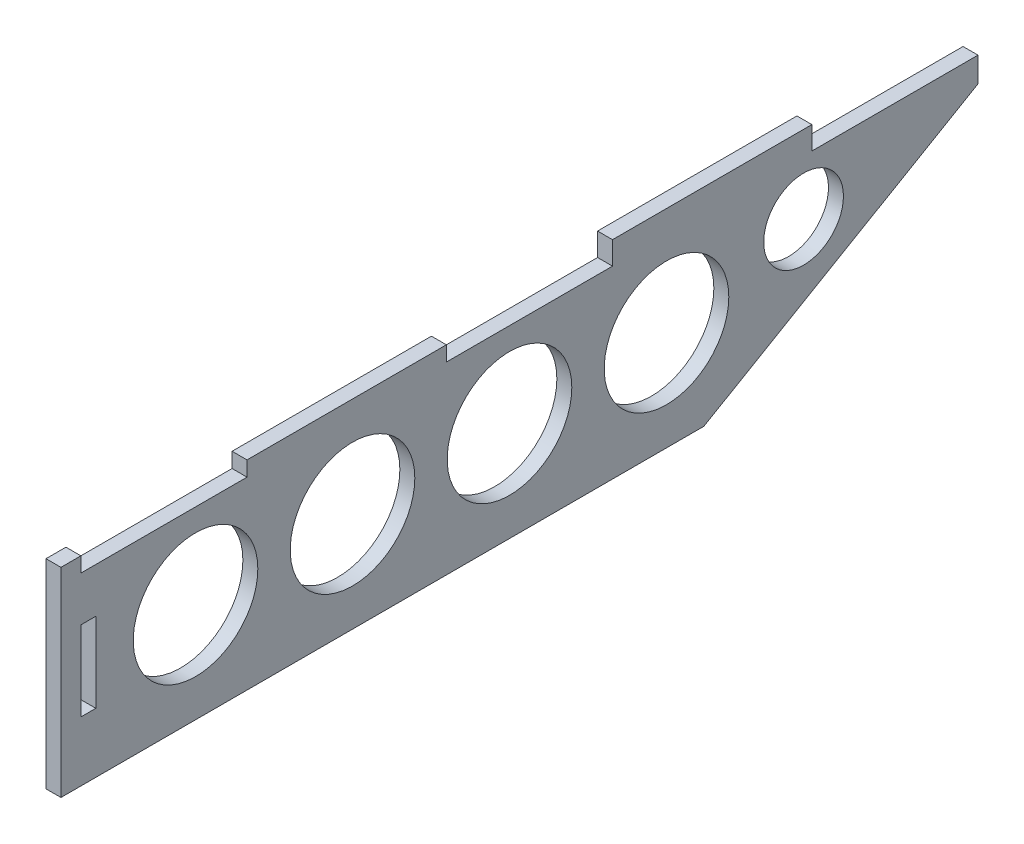
ISO-10303-21;
HEADER;
FILE_DESCRIPTION(('STEP AP214'),'2;1');
FILE_NAME('part.step','',(''),(''),'','','');
FILE_SCHEMA(('AUTOMOTIVE_DESIGN { 1 0 10303 214 1 1 1 1 }'));
ENDSEC;
DATA;
#1=APPLICATION_CONTEXT('core data for automotive mechanical design processes');
#2=APPLICATION_PROTOCOL_DEFINITION('international standard','automotive_design',2000,#1);
#3=PRODUCT_CONTEXT('',#1,'mechanical');
#4=PRODUCT('Part','Part','',(#3));
#5=PRODUCT_RELATED_PRODUCT_CATEGORY('part','',(#4));
#6=PRODUCT_DEFINITION_FORMATION('','',#4);
#7=PRODUCT_DEFINITION_CONTEXT('part definition',#1,'design');
#8=PRODUCT_DEFINITION('design','',#6,#7);
#9=PRODUCT_DEFINITION_SHAPE('','',#8);
#10=(LENGTH_UNIT() NAMED_UNIT(*) SI_UNIT(.MILLI.,.METRE.));
#11=(NAMED_UNIT(*) PLANE_ANGLE_UNIT() SI_UNIT($,.RADIAN.));
#12=(NAMED_UNIT(*) SI_UNIT($,.STERADIAN.) SOLID_ANGLE_UNIT());
#13=UNCERTAINTY_MEASURE_WITH_UNIT(LENGTH_MEASURE(1.E-05),#10,'distance_accuracy_value','');
#14=(GEOMETRIC_REPRESENTATION_CONTEXT(3) GLOBAL_UNCERTAINTY_ASSIGNED_CONTEXT((#13)) GLOBAL_UNIT_ASSIGNED_CONTEXT((#10,
#11,#12)) REPRESENTATION_CONTEXT('',''));
#15=CARTESIAN_POINT('',(0.,0.,0.));
#16=DIRECTION('',(0.,0.,1.));
#17=DIRECTION('',(1.,0.,0.));
#18=AXIS2_PLACEMENT_3D('',#15,#16,#17);
#19=CARTESIAN_POINT('',(3.,-12.,0.));
#20=DIRECTION('',(0.,1.,0.));
#21=DIRECTION('',(0.,0.,1.));
#22=AXIS2_PLACEMENT_3D('',#19,#20,#21);
#23=PLANE('',#22);
#24=DIRECTION('',(0.,0.,-1.));
#25=VECTOR('',#24,1.);
#26=CARTESIAN_POINT('',(0.,-12.,0.));
#27=LINE('',#26,#25);
#28=CARTESIAN_POINT('',(0.,-12.,0.));
#29=VERTEX_POINT('',#28);
#30=CARTESIAN_POINT('',(0.,-12.,-3.));
#31=VERTEX_POINT('',#30);
#32=EDGE_CURVE('E277',#29,#31,#27,.T.);
#33=ORIENTED_EDGE('',*,*,#32,.T.);
#34=DIRECTION('',(-1.,0.,0.));
#35=VECTOR('',#34,1.);
#36=CARTESIAN_POINT('',(3.,-12.,-3.));
#37=LINE('',#36,#35);
#38=CARTESIAN_POINT('',(3.,-12.,-3.));
#39=VERTEX_POINT('',#38);
#40=EDGE_CURVE('E11',#39,#31,#37,.T.);
#41=ORIENTED_EDGE('',*,*,#40,.F.);
#42=DIRECTION('',(0.,0.,-1.));
#43=VECTOR('',#42,1.);
#44=CARTESIAN_POINT('',(3.,-12.,0.));
#45=LINE('',#44,#43);
#46=CARTESIAN_POINT('',(3.,-12.,0.));
#47=VERTEX_POINT('',#46);
#48=EDGE_CURVE('E179',#47,#39,#45,.T.);
#49=ORIENTED_EDGE('',*,*,#48,.F.);
#50=DIRECTION('',(-1.,0.,0.));
#51=VECTOR('',#50,1.);
#52=CARTESIAN_POINT('',(3.,-12.,0.));
#53=LINE('',#52,#51);
#54=EDGE_CURVE('E61',#47,#29,#53,.T.);
#55=ORIENTED_EDGE('',*,*,#54,.T.);
#56=EDGE_LOOP('',(#33,#41,#49,#55));
#57=FACE_BOUND('',#56,.T.);
#58=ADVANCED_FACE('F41',(#57),#23,.F.);
#59=CARTESIAN_POINT('',(3.,0.,-3.));
#60=DIRECTION('',(0.,0.,-1.));
#61=DIRECTION('',(0.,1.,0.));
#62=AXIS2_PLACEMENT_3D('',#59,#60,#61);
#63=PLANE('',#62);
#64=DIRECTION('',(0.,-1.,0.));
#65=VECTOR('',#64,1.);
#66=CARTESIAN_POINT('',(0.,0.,-3.));
#67=LINE('',#66,#65);
#68=CARTESIAN_POINT('',(0.,-28.,-3.));
#69=VERTEX_POINT('',#68);
#70=EDGE_CURVE('E186',#31,#69,#67,.T.);
#71=ORIENTED_EDGE('',*,*,#70,.T.);
#72=DIRECTION('',(-1.,0.,0.));
#73=VECTOR('',#72,1.);
#74=CARTESIAN_POINT('',(3.,-28.,-3.));
#75=LINE('',#74,#73);
#76=CARTESIAN_POINT('',(3.,-28.,-3.));
#77=VERTEX_POINT('',#76);
#78=EDGE_CURVE('E52',#77,#69,#75,.T.);
#79=ORIENTED_EDGE('',*,*,#78,.F.);
#80=DIRECTION('',(0.,-1.,0.));
#81=VECTOR('',#80,1.);
#82=CARTESIAN_POINT('',(3.,0.,-3.));
#83=LINE('',#82,#81);
#84=EDGE_CURVE('E173',#39,#77,#83,.T.);
#85=ORIENTED_EDGE('',*,*,#84,.F.);
#86=ORIENTED_EDGE('',*,*,#40,.T.);
#87=EDGE_LOOP('',(#71,#79,#85,#86));
#88=FACE_BOUND('',#87,.T.);
#89=ADVANCED_FACE('F185',(#88),#63,.F.);
#90=CARTESIAN_POINT('',(3.,-28.,0.));
#91=DIRECTION('',(0.,1.,0.));
#92=DIRECTION('',(0.,0.,1.));
#93=AXIS2_PLACEMENT_3D('',#90,#91,#92);
#94=PLANE('',#93);
#95=DIRECTION('',(0.,0.,-1.));
#96=VECTOR('',#95,1.);
#97=CARTESIAN_POINT('',(0.,-28.,0.));
#98=LINE('',#97,#96);
#99=CARTESIAN_POINT('',(0.,-28.,0.));
#100=VERTEX_POINT('',#99);
#101=EDGE_CURVE('E282',#100,#69,#98,.T.);
#102=ORIENTED_EDGE('',*,*,#101,.F.);
#103=DIRECTION('',(-1.,0.,0.));
#104=VECTOR('',#103,1.);
#105=CARTESIAN_POINT('',(3.,-28.,0.));
#106=LINE('',#105,#104);
#107=CARTESIAN_POINT('',(3.,-28.,0.));
#108=VERTEX_POINT('',#107);
#109=EDGE_CURVE('E115',#108,#100,#106,.T.);
#110=ORIENTED_EDGE('',*,*,#109,.F.);
#111=DIRECTION('',(0.,0.,-1.));
#112=VECTOR('',#111,1.);
#113=CARTESIAN_POINT('',(3.,-28.,0.));
#114=LINE('',#113,#112);
#115=EDGE_CURVE('E178',#108,#77,#114,.T.);
#116=ORIENTED_EDGE('',*,*,#115,.T.);
#117=ORIENTED_EDGE('',*,*,#78,.T.);
#118=EDGE_LOOP('',(#102,#110,#116,#117));
#119=FACE_BOUND('',#118,.T.);
#120=ADVANCED_FACE('F191',(#119),#94,.T.);
#121=CARTESIAN_POINT('',(3.,0.,0.));
#122=DIRECTION('',(0.,1.,0.));
#123=DIRECTION('',(0.,0.,1.));
#124=AXIS2_PLACEMENT_3D('',#121,#122,#123);
#125=PLANE('',#124);
#126=DIRECTION('',(0.,0.,-1.));
#127=VECTOR('',#126,1.);
#128=CARTESIAN_POINT('',(0.,0.,0.));
#129=LINE('',#128,#127);
#130=CARTESIAN_POINT('',(0.,0.,4.));
#131=VERTEX_POINT('',#130);
#132=CARTESIAN_POINT('',(0.,0.,0.));
#133=VERTEX_POINT('',#132);
#134=EDGE_CURVE('E221',#131,#133,#129,.T.);
#135=ORIENTED_EDGE('',*,*,#134,.F.);
#136=DIRECTION('',(-1.,0.,0.));
#137=VECTOR('',#136,1.);
#138=CARTESIAN_POINT('',(3.,0.,4.));
#139=LINE('',#138,#137);
#140=CARTESIAN_POINT('',(3.,0.,4.));
#141=VERTEX_POINT('',#140);
#142=EDGE_CURVE('E45',#141,#131,#139,.T.);
#143=ORIENTED_EDGE('',*,*,#142,.F.);
#144=DIRECTION('',(0.,0.,-1.));
#145=VECTOR('',#144,1.);
#146=CARTESIAN_POINT('',(3.,0.,0.));
#147=LINE('',#146,#145);
#148=CARTESIAN_POINT('',(3.,0.,0.));
#149=VERTEX_POINT('',#148);
#150=EDGE_CURVE('E402',#141,#149,#147,.T.);
#151=ORIENTED_EDGE('',*,*,#150,.T.);
#152=DIRECTION('',(-1.,0.,0.));
#153=VECTOR('',#152,1.);
#154=CARTESIAN_POINT('',(3.,0.,0.));
#155=LINE('',#154,#153);
#156=EDGE_CURVE('E196',#149,#133,#155,.T.);
#157=ORIENTED_EDGE('',*,*,#156,.T.);
#158=EDGE_LOOP('',(#135,#143,#151,#157));
#159=FACE_BOUND('',#158,.T.);
#160=ADVANCED_FACE('F337',(#159),#125,.T.);
#161=CARTESIAN_POINT('',(3.,0.,4.));
#162=DIRECTION('',(0.,0.,1.));
#163=DIRECTION('',(1.,0.,0.));
#164=AXIS2_PLACEMENT_3D('',#161,#162,#163);
#165=PLANE('',#164);
#166=DIRECTION('',(0.,1.,0.));
#167=VECTOR('',#166,1.);
#168=CARTESIAN_POINT('',(0.,0.,4.));
#169=LINE('',#168,#167);
#170=CARTESIAN_POINT('',(0.,-40.,4.));
#171=VERTEX_POINT('',#170);
#172=EDGE_CURVE('E225',#171,#131,#169,.T.);
#173=ORIENTED_EDGE('',*,*,#172,.F.);
#174=DIRECTION('',(-1.,0.,0.));
#175=VECTOR('',#174,1.);
#176=CARTESIAN_POINT('',(3.,-40.,4.));
#177=LINE('',#176,#175);
#178=CARTESIAN_POINT('',(3.,-40.,4.));
#179=VERTEX_POINT('',#178);
#180=EDGE_CURVE('E325',#179,#171,#177,.T.);
#181=ORIENTED_EDGE('',*,*,#180,.F.);
#182=DIRECTION('',(0.,1.,0.));
#183=VECTOR('',#182,1.);
#184=CARTESIAN_POINT('',(3.,0.,4.));
#185=LINE('',#184,#183);
#186=EDGE_CURVE('E336',#179,#141,#185,.T.);
#187=ORIENTED_EDGE('',*,*,#186,.T.);
#188=ORIENTED_EDGE('',*,*,#142,.T.);
#189=EDGE_LOOP('',(#173,#181,#187,#188));
#190=FACE_BOUND('',#189,.T.);
#191=ADVANCED_FACE('F334',(#190),#165,.T.);
#192=CARTESIAN_POINT('',(3.,-40.,0.));
#193=DIRECTION('',(0.,-1.,0.));
#194=DIRECTION('',(0.,0.,-1.));
#195=AXIS2_PLACEMENT_3D('',#192,#193,#194);
#196=PLANE('',#195);
#197=DIRECTION('',(0.,0.,1.));
#198=VECTOR('',#197,1.);
#199=CARTESIAN_POINT('',(0.,-40.,0.));
#200=LINE('',#199,#198);
#201=CARTESIAN_POINT('',(0.,-40.,-125.));
#202=VERTEX_POINT('',#201);
#203=EDGE_CURVE('E229',#202,#171,#200,.T.);
#204=ORIENTED_EDGE('',*,*,#203,.F.);
#205=DIRECTION('',(-1.,0.,0.));
#206=VECTOR('',#205,1.);
#207=CARTESIAN_POINT('',(3.,-40.,-125.));
#208=LINE('',#207,#206);
#209=CARTESIAN_POINT('',(3.,-40.,-125.));
#210=VERTEX_POINT('',#209);
#211=EDGE_CURVE('E323',#210,#202,#208,.T.);
#212=ORIENTED_EDGE('',*,*,#211,.F.);
#213=DIRECTION('',(0.,0.,1.));
#214=VECTOR('',#213,1.);
#215=CARTESIAN_POINT('',(3.,-40.,0.));
#216=LINE('',#215,#214);
#217=EDGE_CURVE('E345',#210,#179,#216,.T.);
#218=ORIENTED_EDGE('',*,*,#217,.T.);
#219=ORIENTED_EDGE('',*,*,#180,.T.);
#220=EDGE_LOOP('',(#204,#212,#218,#219));
#221=FACE_BOUND('',#220,.T.);
#222=ADVANCED_FACE('F343',(#221),#196,.T.);
#223=CARTESIAN_POINT('',(3.,-84.2183255124722,-48.9997530254384));
#224=DIRECTION('',(0.,-0.864348337709377,-0.502893578303638));
#225=DIRECTION('',(0.,0.502893578303638,-0.864348337709377));
#226=AXIS2_PLACEMENT_3D('',#223,#224,#225);
#227=PLANE('',#226);
#228=DIRECTION('',(0.,-0.502893578303638,0.864348337709377));
#229=VECTOR('',#228,1.);
#230=CARTESIAN_POINT('',(0.,-84.2183255124722,-48.9997530254384));
#231=LINE('',#230,#229);
#232=CARTESIAN_POINT('',(0.,-8.00000000000001,-180.));
#233=VERTEX_POINT('',#232);
#234=EDGE_CURVE('E233',#233,#202,#231,.T.);
#235=ORIENTED_EDGE('',*,*,#234,.F.);
#236=DIRECTION('',(-1.,0.,0.));
#237=VECTOR('',#236,1.);
#238=CARTESIAN_POINT('',(3.,-8.00000000000001,-180.));
#239=LINE('',#238,#237);
#240=CARTESIAN_POINT('',(3.,-8.00000000000001,-180.));
#241=VERTEX_POINT('',#240);
#242=EDGE_CURVE('E320',#241,#233,#239,.T.);
#243=ORIENTED_EDGE('',*,*,#242,.F.);
#244=DIRECTION('',(0.,-0.502893578303638,0.864348337709377));
#245=VECTOR('',#244,1.);
#246=CARTESIAN_POINT('',(3.,-84.2183255124722,-48.9997530254384));
#247=LINE('',#246,#245);
#248=EDGE_CURVE('E351',#241,#210,#247,.T.);
#249=ORIENTED_EDGE('',*,*,#248,.T.);
#250=ORIENTED_EDGE('',*,*,#211,.T.);
#251=EDGE_LOOP('',(#235,#243,#249,#250));
#252=FACE_BOUND('',#251,.T.);
#253=ADVANCED_FACE('F355',(#252),#227,.T.);
#254=CARTESIAN_POINT('',(3.,0.,-180.));
#255=DIRECTION('',(0.,0.,-1.));
#256=DIRECTION('',(-1.,0.,0.));
#257=AXIS2_PLACEMENT_3D('',#254,#255,#256);
#258=PLANE('',#257);
#259=DIRECTION('',(0.,-1.,0.));
#260=VECTOR('',#259,1.);
#261=CARTESIAN_POINT('',(0.,0.,-180.));
#262=LINE('',#261,#260);
#263=CARTESIAN_POINT('',(0.,-3.,-180.));
#264=VERTEX_POINT('',#263);
#265=EDGE_CURVE('E237',#264,#233,#262,.T.);
#266=ORIENTED_EDGE('',*,*,#265,.F.);
#267=DIRECTION('',(-1.,0.,0.));
#268=VECTOR('',#267,1.);
#269=CARTESIAN_POINT('',(3.,-3.,-180.));
#270=LINE('',#269,#268);
#271=CARTESIAN_POINT('',(3.,-3.,-180.));
#272=VERTEX_POINT('',#271);
#273=EDGE_CURVE('E317',#272,#264,#270,.T.);
#274=ORIENTED_EDGE('',*,*,#273,.F.);
#275=DIRECTION('',(0.,-1.,0.));
#276=VECTOR('',#275,1.);
#277=CARTESIAN_POINT('',(3.,0.,-180.));
#278=LINE('',#277,#276);
#279=EDGE_CURVE('E357',#272,#241,#278,.T.);
#280=ORIENTED_EDGE('',*,*,#279,.T.);
#281=ORIENTED_EDGE('',*,*,#242,.T.);
#282=EDGE_LOOP('',(#266,#274,#280,#281));
#283=FACE_BOUND('',#282,.T.);
#284=ADVANCED_FACE('F520',(#283),#258,.T.);
#285=CARTESIAN_POINT('',(3.,-3.,0.));
#286=DIRECTION('',(0.,1.,0.));
#287=DIRECTION('',(0.,0.,1.));
#288=AXIS2_PLACEMENT_3D('',#285,#286,#287);
#289=PLANE('',#288);
#290=DIRECTION('',(0.,0.,-1.));
#291=VECTOR('',#290,1.);
#292=CARTESIAN_POINT('',(0.,-3.,0.));
#293=LINE('',#292,#291);
#294=CARTESIAN_POINT('',(0.,-3.,-146.666666666667));
#295=VERTEX_POINT('',#294);
#296=EDGE_CURVE('E241',#295,#264,#293,.T.);
#297=ORIENTED_EDGE('',*,*,#296,.F.);
#298=DIRECTION('',(-1.,0.,0.));
#299=VECTOR('',#298,1.);
#300=CARTESIAN_POINT('',(3.,-3.,-146.666666666667));
#301=LINE('',#300,#299);
#302=CARTESIAN_POINT('',(3.,-3.,-146.666666666667));
#303=VERTEX_POINT('',#302);
#304=EDGE_CURVE('E314',#303,#295,#301,.T.);
#305=ORIENTED_EDGE('',*,*,#304,.F.);
#306=DIRECTION('',(0.,0.,-1.));
#307=VECTOR('',#306,1.);
#308=CARTESIAN_POINT('',(3.,-3.,0.));
#309=LINE('',#308,#307);
#310=EDGE_CURVE('E360',#303,#272,#309,.T.);
#311=ORIENTED_EDGE('',*,*,#310,.T.);
#312=ORIENTED_EDGE('',*,*,#273,.T.);
#313=EDGE_LOOP('',(#297,#305,#311,#312));
#314=FACE_BOUND('',#313,.T.);
#315=ADVANCED_FACE('F516',(#314),#289,.T.);
#316=CARTESIAN_POINT('',(3.,0.,-146.666666666667));
#317=DIRECTION('',(0.,0.,-1.));
#318=DIRECTION('',(-1.,0.,0.));
#319=AXIS2_PLACEMENT_3D('',#316,#317,#318);
#320=PLANE('',#319);
#321=DIRECTION('',(0.,-1.,0.));
#322=VECTOR('',#321,1.);
#323=CARTESIAN_POINT('',(0.,0.,-146.666666666667));
#324=LINE('',#323,#322);
#325=CARTESIAN_POINT('',(0.,1.6,-146.666666666667));
#326=VERTEX_POINT('',#325);
#327=EDGE_CURVE('E245',#326,#295,#324,.T.);
#328=ORIENTED_EDGE('',*,*,#327,.F.);
#329=DIRECTION('',(1.,0.,0.));
#330=VECTOR('',#329,1.);
#331=CARTESIAN_POINT('',(0.,1.6,-146.666666666667));
#332=LINE('',#331,#330);
#333=CARTESIAN_POINT('',(3.,1.6,-146.666666666667));
#334=VERTEX_POINT('',#333);
#335=EDGE_CURVE('E436',#326,#334,#332,.T.);
#336=ORIENTED_EDGE('',*,*,#335,.T.);
#337=DIRECTION('',(0.,-1.,0.));
#338=VECTOR('',#337,1.);
#339=CARTESIAN_POINT('',(3.,0.,-146.666666666667));
#340=LINE('',#339,#338);
#341=EDGE_CURVE('E367',#334,#303,#340,.T.);
#342=ORIENTED_EDGE('',*,*,#341,.T.);
#343=ORIENTED_EDGE('',*,*,#304,.T.);
#344=EDGE_LOOP('',(#328,#336,#342,#343));
#345=FACE_BOUND('',#344,.T.);
#346=ADVANCED_FACE('F513',(#345),#320,.T.);
#347=CARTESIAN_POINT('',(3.,-4.93432455388958E-13,-106.666666666667));
#348=DIRECTION('',(0.,0.,-1.));
#349=DIRECTION('',(0.,1.,0.));
#350=AXIS2_PLACEMENT_3D('',#347,#348,#349);
#351=PLANE('',#350);
#352=DIRECTION('',(0.,-1.,0.));
#353=VECTOR('',#352,1.);
#354=CARTESIAN_POINT('',(0.,-4.93432455388958E-13,-106.666666666667));
#355=LINE('',#354,#353);
#356=CARTESIAN_POINT('',(0.,1.6,-106.666666666667));
#357=VERTEX_POINT('',#356);
#358=CARTESIAN_POINT('',(0.,-3.,-106.666666666667));
#359=VERTEX_POINT('',#358);
#360=EDGE_CURVE('E249',#357,#359,#355,.T.);
#361=ORIENTED_EDGE('',*,*,#360,.T.);
#362=DIRECTION('',(-1.,0.,0.));
#363=VECTOR('',#362,1.);
#364=CARTESIAN_POINT('',(3.,-3.,-106.666666666667));
#365=LINE('',#364,#363);
#366=CARTESIAN_POINT('',(3.,-3.,-106.666666666667));
#367=VERTEX_POINT('',#366);
#368=EDGE_CURVE('E311',#367,#359,#365,.T.);
#369=ORIENTED_EDGE('',*,*,#368,.F.);
#370=DIRECTION('',(0.,-1.,0.));
#371=VECTOR('',#370,1.);
#372=CARTESIAN_POINT('',(3.,-4.93432455388958E-13,-106.666666666667));
#373=LINE('',#372,#371);
#374=CARTESIAN_POINT('',(3.,1.6,-106.666666666667));
#375=VERTEX_POINT('',#374);
#376=EDGE_CURVE('E371',#375,#367,#373,.T.);
#377=ORIENTED_EDGE('',*,*,#376,.F.);
#378=DIRECTION('',(1.,0.,0.));
#379=VECTOR('',#378,1.);
#380=CARTESIAN_POINT('',(0.,1.6,-106.666666666667));
#381=LINE('',#380,#379);
#382=EDGE_CURVE('E205',#357,#375,#381,.T.);
#383=ORIENTED_EDGE('',*,*,#382,.F.);
#384=EDGE_LOOP('',(#361,#369,#377,#383));
#385=FACE_BOUND('',#384,.T.);
#386=ADVANCED_FACE('F427',(#385),#351,.F.);
#387=CARTESIAN_POINT('',(3.,-3.,0.));
#388=DIRECTION('',(0.,1.,0.));
#389=DIRECTION('',(0.,0.,1.));
#390=AXIS2_PLACEMENT_3D('',#387,#388,#389);
#391=PLANE('',#390);
#392=DIRECTION('',(0.,0.,-1.));
#393=VECTOR('',#392,1.);
#394=CARTESIAN_POINT('',(0.,-3.,0.));
#395=LINE('',#394,#393);
#396=CARTESIAN_POINT('',(0.,-3.,-73.3333333333333));
#397=VERTEX_POINT('',#396);
#398=EDGE_CURVE('E259',#397,#359,#395,.T.);
#399=ORIENTED_EDGE('',*,*,#398,.F.);
#400=DIRECTION('',(-1.,0.,0.));
#401=VECTOR('',#400,1.);
#402=CARTESIAN_POINT('',(3.,-3.,-73.3333333333333));
#403=LINE('',#402,#401);
#404=CARTESIAN_POINT('',(3.,-3.,-73.3333333333333));
#405=VERTEX_POINT('',#404);
#406=EDGE_CURVE('E308',#405,#397,#403,.T.);
#407=ORIENTED_EDGE('',*,*,#406,.F.);
#408=DIRECTION('',(0.,0.,-1.));
#409=VECTOR('',#408,1.);
#410=CARTESIAN_POINT('',(3.,-3.,0.));
#411=LINE('',#410,#409);
#412=EDGE_CURVE('E380',#405,#367,#411,.T.);
#413=ORIENTED_EDGE('',*,*,#412,.T.);
#414=ORIENTED_EDGE('',*,*,#368,.T.);
#415=EDGE_LOOP('',(#399,#407,#413,#414));
#416=FACE_BOUND('',#415,.T.);
#417=ADVANCED_FACE('F422',(#416),#391,.T.);
#418=CARTESIAN_POINT('',(3.,0.,-73.3333333333333));
#419=DIRECTION('',(0.,0.,-1.));
#420=DIRECTION('',(-1.,0.,0.));
#421=AXIS2_PLACEMENT_3D('',#418,#419,#420);
#422=PLANE('',#421);
#423=DIRECTION('',(0.,-1.,0.));
#424=VECTOR('',#423,1.);
#425=CARTESIAN_POINT('',(0.,0.,-73.3333333333333));
#426=LINE('',#425,#424);
#427=CARTESIAN_POINT('',(0.,0.,-73.3333333333333));
#428=VERTEX_POINT('',#427);
#429=EDGE_CURVE('E255',#428,#397,#426,.T.);
#430=ORIENTED_EDGE('',*,*,#429,.F.);
#431=DIRECTION('',(-1.,0.,0.));
#432=VECTOR('',#431,1.);
#433=CARTESIAN_POINT('',(3.,0.,-73.3333333333333));
#434=LINE('',#433,#432);
#435=CARTESIAN_POINT('',(3.,0.,-73.3333333333333));
#436=VERTEX_POINT('',#435);
#437=EDGE_CURVE('E305',#436,#428,#434,.T.);
#438=ORIENTED_EDGE('',*,*,#437,.F.);
#439=DIRECTION('',(0.,-1.,0.));
#440=VECTOR('',#439,1.);
#441=CARTESIAN_POINT('',(3.,0.,-73.3333333333333));
#442=LINE('',#441,#440);
#443=EDGE_CURVE('E377',#436,#405,#442,.T.);
#444=ORIENTED_EDGE('',*,*,#443,.T.);
#445=ORIENTED_EDGE('',*,*,#406,.T.);
#446=EDGE_LOOP('',(#430,#438,#444,#445));
#447=FACE_BOUND('',#446,.T.);
#448=ADVANCED_FACE('F416',(#447),#422,.T.);
#449=CARTESIAN_POINT('',(3.,0.,0.));
#450=DIRECTION('',(0.,1.,0.));
#451=DIRECTION('',(0.,0.,1.));
#452=AXIS2_PLACEMENT_3D('',#449,#450,#451);
#453=PLANE('',#452);
#454=DIRECTION('',(0.,0.,-1.));
#455=VECTOR('',#454,1.);
#456=CARTESIAN_POINT('',(0.,0.,0.));
#457=LINE('',#456,#455);
#458=CARTESIAN_POINT('',(0.,0.,-33.3333333333333));
#459=VERTEX_POINT('',#458);
#460=EDGE_CURVE('E250',#459,#428,#457,.T.);
#461=ORIENTED_EDGE('',*,*,#460,.F.);
#462=DIRECTION('',(-1.,0.,0.));
#463=VECTOR('',#462,1.);
#464=CARTESIAN_POINT('',(3.,0.,-33.3333333333333));
#465=LINE('',#464,#463);
#466=CARTESIAN_POINT('',(3.,0.,-33.3333333333333));
#467=VERTEX_POINT('',#466);
#468=EDGE_CURVE('E302',#467,#459,#465,.T.);
#469=ORIENTED_EDGE('',*,*,#468,.F.);
#470=DIRECTION('',(0.,0.,-1.));
#471=VECTOR('',#470,1.);
#472=CARTESIAN_POINT('',(3.,0.,0.));
#473=LINE('',#472,#471);
#474=EDGE_CURVE('E372',#467,#436,#473,.T.);
#475=ORIENTED_EDGE('',*,*,#474,.T.);
#476=ORIENTED_EDGE('',*,*,#437,.T.);
#477=EDGE_LOOP('',(#461,#469,#475,#476));
#478=FACE_BOUND('',#477,.T.);
#479=ADVANCED_FACE('F412',(#478),#453,.T.);
#480=CARTESIAN_POINT('',(3.,0.,-33.3333333333333));
#481=DIRECTION('',(0.,0.,-1.));
#482=DIRECTION('',(0.,1.,0.));
#483=AXIS2_PLACEMENT_3D('',#480,#481,#482);
#484=PLANE('',#483);
#485=DIRECTION('',(0.,-1.,0.));
#486=VECTOR('',#485,1.);
#487=CARTESIAN_POINT('',(0.,0.,-33.3333333333333));
#488=LINE('',#487,#486);
#489=CARTESIAN_POINT('',(0.,-3.,-33.3333333333333));
#490=VERTEX_POINT('',#489);
#491=EDGE_CURVE('E254',#459,#490,#488,.T.);
#492=ORIENTED_EDGE('',*,*,#491,.T.);
#493=DIRECTION('',(-1.,0.,0.));
#494=VECTOR('',#493,1.);
#495=CARTESIAN_POINT('',(3.,-3.,-33.3333333333333));
#496=LINE('',#495,#494);
#497=CARTESIAN_POINT('',(3.,-3.,-33.3333333333333));
#498=VERTEX_POINT('',#497);
#499=EDGE_CURVE('E299',#498,#490,#496,.T.);
#500=ORIENTED_EDGE('',*,*,#499,.F.);
#501=DIRECTION('',(0.,-1.,0.));
#502=VECTOR('',#501,1.);
#503=CARTESIAN_POINT('',(3.,0.,-33.3333333333333));
#504=LINE('',#503,#502);
#505=EDGE_CURVE('E376',#467,#498,#504,.T.);
#506=ORIENTED_EDGE('',*,*,#505,.F.);
#507=ORIENTED_EDGE('',*,*,#468,.T.);
#508=EDGE_LOOP('',(#492,#500,#506,#507));
#509=FACE_BOUND('',#508,.T.);
#510=ADVANCED_FACE('F503',(#509),#484,.F.);
#511=CARTESIAN_POINT('',(3.,-3.,0.));
#512=DIRECTION('',(0.,1.,0.));
#513=DIRECTION('',(0.,0.,1.));
#514=AXIS2_PLACEMENT_3D('',#511,#512,#513);
#515=PLANE('',#514);
#516=DIRECTION('',(0.,0.,-1.));
#517=VECTOR('',#516,1.);
#518=CARTESIAN_POINT('',(0.,-3.,0.));
#519=LINE('',#518,#517);
#520=CARTESIAN_POINT('',(0.,-3.,0.));
#521=VERTEX_POINT('',#520);
#522=EDGE_CURVE('E269',#521,#490,#519,.T.);
#523=ORIENTED_EDGE('',*,*,#522,.F.);
#524=DIRECTION('',(-1.,0.,0.));
#525=VECTOR('',#524,1.);
#526=CARTESIAN_POINT('',(3.,-3.,0.));
#527=LINE('',#526,#525);
#528=CARTESIAN_POINT('',(3.,-3.,0.));
#529=VERTEX_POINT('',#528);
#530=EDGE_CURVE('E296',#529,#521,#527,.T.);
#531=ORIENTED_EDGE('',*,*,#530,.F.);
#532=DIRECTION('',(0.,0.,-1.));
#533=VECTOR('',#532,1.);
#534=CARTESIAN_POINT('',(3.,-3.,0.));
#535=LINE('',#534,#533);
#536=EDGE_CURVE('E389',#529,#498,#535,.T.);
#537=ORIENTED_EDGE('',*,*,#536,.T.);
#538=ORIENTED_EDGE('',*,*,#499,.T.);
#539=EDGE_LOOP('',(#523,#531,#537,#538));
#540=FACE_BOUND('',#539,.T.);
#541=ADVANCED_FACE('F407',(#540),#515,.T.);
#542=CARTESIAN_POINT('',(3.,0.,0.));
#543=DIRECTION('',(0.,0.,-1.));
#544=DIRECTION('',(0.,1.,0.));
#545=AXIS2_PLACEMENT_3D('',#542,#543,#544);
#546=PLANE('',#545);
#547=DIRECTION('',(0.,-1.,0.));
#548=VECTOR('',#547,1.);
#549=CARTESIAN_POINT('',(0.,0.,0.));
#550=LINE('',#549,#548);
#551=EDGE_CURVE('E273',#133,#521,#550,.T.);
#552=ORIENTED_EDGE('',*,*,#551,.F.);
#553=ORIENTED_EDGE('',*,*,#156,.F.);
#554=DIRECTION('',(0.,-1.,0.));
#555=VECTOR('',#554,1.);
#556=CARTESIAN_POINT('',(3.,0.,0.));
#557=LINE('',#556,#555);
#558=EDGE_CURVE('E393',#149,#529,#557,.T.);
#559=ORIENTED_EDGE('',*,*,#558,.T.);
#560=ORIENTED_EDGE('',*,*,#530,.T.);
#561=EDGE_LOOP('',(#552,#553,#559,#560));
#562=FACE_BOUND('',#561,.T.);
#563=ADVANCED_FACE('F399',(#562),#546,.T.);
#564=CARTESIAN_POINT('',(3.,-20.,-23.));
#565=DIRECTION('',(-1.,0.,0.));
#566=DIRECTION('',(0.,0.,1.));
#567=AXIS2_PLACEMENT_3D('',#564,#565,#566);
#568=CYLINDRICAL_SURFACE('',#567,12.5);
#569=CARTESIAN_POINT('',(3.,-20.,-23.));
#570=DIRECTION('',(1.,0.,0.));
#571=DIRECTION('',(0.,0.,-1.));
#572=AXIS2_PLACEMENT_3D('',#569,#570,#571);
#573=CIRCLE('',#572,12.5);
#574=CARTESIAN_POINT('',(3.,-20.,-35.5));
#575=VERTEX_POINT('',#574);
#576=EDGE_CURVE('E465',#575,#575,#573,.T.);
#577=ORIENTED_EDGE('',*,*,#576,.T.);
#578=EDGE_LOOP('',(#577));
#579=FACE_BOUND('',#578,.T.);
#580=CARTESIAN_POINT('',(0.,-20.,-23.));
#581=DIRECTION('',(1.,0.,0.));
#582=DIRECTION('',(0.,0.,-1.));
#583=AXIS2_PLACEMENT_3D('',#580,#581,#582);
#584=CIRCLE('',#583,12.5);
#585=CARTESIAN_POINT('',(0.,-20.,-35.5));
#586=VERTEX_POINT('',#585);
#587=EDGE_CURVE('E217',#586,#586,#584,.T.);
#588=ORIENTED_EDGE('',*,*,#587,.F.);
#589=EDGE_LOOP('',(#588));
#590=FACE_BOUND('',#589,.T.);
#591=ADVANCED_FACE('F473',(#579,#590),#568,.F.);
#592=CARTESIAN_POINT('',(3.,-20.,-54.5));
#593=DIRECTION('',(-1.,0.,0.));
#594=DIRECTION('',(0.,0.,1.));
#595=AXIS2_PLACEMENT_3D('',#592,#593,#594);
#596=CYLINDRICAL_SURFACE('',#595,12.5);
#597=CARTESIAN_POINT('',(3.,-20.,-54.5));
#598=DIRECTION('',(1.,0.,0.));
#599=DIRECTION('',(0.,0.,-1.));
#600=AXIS2_PLACEMENT_3D('',#597,#598,#599);
#601=CIRCLE('',#600,12.5);
#602=CARTESIAN_POINT('',(3.,-20.,-67.));
#603=VERTEX_POINT('',#602);
#604=EDGE_CURVE('E461',#603,#603,#601,.T.);
#605=ORIENTED_EDGE('',*,*,#604,.T.);
#606=EDGE_LOOP('',(#605));
#607=FACE_BOUND('',#606,.T.);
#608=CARTESIAN_POINT('',(0.,-20.,-54.5));
#609=DIRECTION('',(1.,0.,0.));
#610=DIRECTION('',(0.,0.,-1.));
#611=AXIS2_PLACEMENT_3D('',#608,#609,#610);
#612=CIRCLE('',#611,12.5);
#613=CARTESIAN_POINT('',(0.,-20.,-67.));
#614=VERTEX_POINT('',#613);
#615=EDGE_CURVE('E213',#614,#614,#612,.T.);
#616=ORIENTED_EDGE('',*,*,#615,.F.);
#617=EDGE_LOOP('',(#616));
#618=FACE_BOUND('',#617,.T.);
#619=ADVANCED_FACE('F535',(#607,#618),#596,.F.);
#620=CARTESIAN_POINT('',(3.,-20.,-86.));
#621=DIRECTION('',(-1.,0.,0.));
#622=DIRECTION('',(0.,0.,1.));
#623=AXIS2_PLACEMENT_3D('',#620,#621,#622);
#624=CYLINDRICAL_SURFACE('',#623,12.5);
#625=CARTESIAN_POINT('',(3.,-20.,-86.));
#626=DIRECTION('',(1.,0.,0.));
#627=DIRECTION('',(0.,0.,-1.));
#628=AXIS2_PLACEMENT_3D('',#625,#626,#627);
#629=CIRCLE('',#628,12.5);
#630=CARTESIAN_POINT('',(3.,-20.,-98.5));
#631=VERTEX_POINT('',#630);
#632=EDGE_CURVE('E457',#631,#631,#629,.T.);
#633=ORIENTED_EDGE('',*,*,#632,.T.);
#634=EDGE_LOOP('',(#633));
#635=FACE_BOUND('',#634,.T.);
#636=CARTESIAN_POINT('',(0.,-20.,-86.));
#637=DIRECTION('',(1.,0.,0.));
#638=DIRECTION('',(0.,0.,-1.));
#639=AXIS2_PLACEMENT_3D('',#636,#637,#638);
#640=CIRCLE('',#639,12.5);
#641=CARTESIAN_POINT('',(0.,-20.,-98.5));
#642=VERTEX_POINT('',#641);
#643=EDGE_CURVE('E209',#642,#642,#640,.T.);
#644=ORIENTED_EDGE('',*,*,#643,.F.);
#645=EDGE_LOOP('',(#644));
#646=FACE_BOUND('',#645,.T.);
#647=ADVANCED_FACE('F538',(#635,#646),#624,.F.);
#648=CARTESIAN_POINT('',(3.,-20.,-117.5));
#649=DIRECTION('',(-1.,0.,0.));
#650=DIRECTION('',(0.,0.,1.));
#651=AXIS2_PLACEMENT_3D('',#648,#649,#650);
#652=CYLINDRICAL_SURFACE('',#651,12.5);
#653=CARTESIAN_POINT('',(3.,-20.,-117.5));
#654=DIRECTION('',(1.,0.,0.));
#655=DIRECTION('',(0.,0.,-1.));
#656=AXIS2_PLACEMENT_3D('',#653,#654,#655);
#657=CIRCLE('',#656,12.5);
#658=CARTESIAN_POINT('',(3.,-20.,-130.));
#659=VERTEX_POINT('',#658);
#660=EDGE_CURVE('E453',#659,#659,#657,.T.);
#661=ORIENTED_EDGE('',*,*,#660,.T.);
#662=EDGE_LOOP('',(#661));
#663=FACE_BOUND('',#662,.T.);
#664=CARTESIAN_POINT('',(0.,-20.,-117.5));
#665=DIRECTION('',(1.,0.,0.));
#666=DIRECTION('',(0.,0.,-1.));
#667=AXIS2_PLACEMENT_3D('',#664,#665,#666);
#668=CIRCLE('',#667,12.5);
#669=CARTESIAN_POINT('',(0.,-20.,-130.));
#670=VERTEX_POINT('',#669);
#671=EDGE_CURVE('E204',#670,#670,#668,.T.);
#672=ORIENTED_EDGE('',*,*,#671,.F.);
#673=EDGE_LOOP('',(#672));
#674=FACE_BOUND('',#673,.T.);
#675=ADVANCED_FACE('F541',(#663,#674),#652,.F.);
#676=CARTESIAN_POINT('',(3.,-14.,-145.));
#677=DIRECTION('',(-1.,0.,0.));
#678=DIRECTION('',(0.,0.,1.));
#679=AXIS2_PLACEMENT_3D('',#676,#677,#678);
#680=CYLINDRICAL_SURFACE('',#679,8.00000000000001);
#681=CARTESIAN_POINT('',(3.,-14.,-145.));
#682=DIRECTION('',(1.,0.,0.));
#683=DIRECTION('',(0.,0.,-1.));
#684=AXIS2_PLACEMENT_3D('',#681,#682,#683);
#685=CIRCLE('',#684,8.00000000000001);
#686=CARTESIAN_POINT('',(3.,-14.,-153.));
#687=VERTEX_POINT('',#686);
#688=EDGE_CURVE('E289',#687,#687,#685,.T.);
#689=ORIENTED_EDGE('',*,*,#688,.T.);
#690=EDGE_LOOP('',(#689));
#691=FACE_BOUND('',#690,.T.);
#692=CARTESIAN_POINT('',(0.,-14.,-145.));
#693=DIRECTION('',(1.,0.,0.));
#694=DIRECTION('',(0.,0.,-1.));
#695=AXIS2_PLACEMENT_3D('',#692,#693,#694);
#696=CIRCLE('',#695,8.00000000000001);
#697=CARTESIAN_POINT('',(0.,-14.,-153.));
#698=VERTEX_POINT('',#697);
#699=EDGE_CURVE('E200',#698,#698,#696,.T.);
#700=ORIENTED_EDGE('',*,*,#699,.F.);
#701=EDGE_LOOP('',(#700));
#702=FACE_BOUND('',#701,.T.);
#703=ADVANCED_FACE('F43',(#691,#702),#680,.F.);
#704=CARTESIAN_POINT('',(3.,0.,0.));
#705=DIRECTION('',(0.,0.,-1.));
#706=DIRECTION('',(0.,1.,0.));
#707=AXIS2_PLACEMENT_3D('',#704,#705,#706);
#708=PLANE('',#707);
#709=DIRECTION('',(0.,-1.,0.));
#710=VECTOR('',#709,1.);
#711=CARTESIAN_POINT('',(0.,0.,0.));
#712=LINE('',#711,#710);
#713=EDGE_CURVE('E285',#29,#100,#712,.T.);
#714=ORIENTED_EDGE('',*,*,#713,.F.);
#715=ORIENTED_EDGE('',*,*,#54,.F.);
#716=DIRECTION('',(0.,-1.,0.));
#717=VECTOR('',#716,1.);
#718=CARTESIAN_POINT('',(3.,0.,0.));
#719=LINE('',#718,#717);
#720=EDGE_CURVE('E193',#47,#108,#719,.T.);
#721=ORIENTED_EDGE('',*,*,#720,.T.);
#722=ORIENTED_EDGE('',*,*,#109,.T.);
#723=EDGE_LOOP('',(#714,#715,#721,#722));
#724=FACE_BOUND('',#723,.T.);
#725=ADVANCED_FACE('F477',(#724),#708,.T.);
#726=CARTESIAN_POINT('',(3.,0.,0.));
#727=DIRECTION('',(1.,0.,0.));
#728=DIRECTION('',(0.,0.,-1.));
#729=AXIS2_PLACEMENT_3D('',#726,#727,#728);
#730=PLANE('',#729);
#731=ORIENTED_EDGE('',*,*,#688,.F.);
#732=EDGE_LOOP('',(#731));
#733=FACE_BOUND('',#732,.T.);
#734=ORIENTED_EDGE('',*,*,#660,.F.);
#735=EDGE_LOOP('',(#734));
#736=FACE_BOUND('',#735,.T.);
#737=ORIENTED_EDGE('',*,*,#632,.F.);
#738=EDGE_LOOP('',(#737));
#739=FACE_BOUND('',#738,.T.);
#740=ORIENTED_EDGE('',*,*,#604,.F.);
#741=EDGE_LOOP('',(#740));
#742=FACE_BOUND('',#741,.T.);
#743=ORIENTED_EDGE('',*,*,#576,.F.);
#744=EDGE_LOOP('',(#743));
#745=FACE_BOUND('',#744,.T.);
#746=ORIENTED_EDGE('',*,*,#150,.F.);
#747=ORIENTED_EDGE('',*,*,#186,.F.);
#748=ORIENTED_EDGE('',*,*,#217,.F.);
#749=ORIENTED_EDGE('',*,*,#248,.F.);
#750=ORIENTED_EDGE('',*,*,#279,.F.);
#751=ORIENTED_EDGE('',*,*,#310,.F.);
#752=ORIENTED_EDGE('',*,*,#341,.F.);
#753=DIRECTION('',(0.,0.,1.));
#754=VECTOR('',#753,1.);
#755=CARTESIAN_POINT('',(3.,1.6,-106.666666666667));
#756=LINE('',#755,#754);
#757=EDGE_CURVE('E443',#334,#375,#756,.T.);
#758=ORIENTED_EDGE('',*,*,#757,.T.);
#759=ORIENTED_EDGE('',*,*,#376,.T.);
#760=ORIENTED_EDGE('',*,*,#412,.F.);
#761=ORIENTED_EDGE('',*,*,#443,.F.);
#762=ORIENTED_EDGE('',*,*,#474,.F.);
#763=ORIENTED_EDGE('',*,*,#505,.T.);
#764=ORIENTED_EDGE('',*,*,#536,.F.);
#765=ORIENTED_EDGE('',*,*,#558,.F.);
#766=EDGE_LOOP('',(#746,#747,#748,#749,#750,#751,#752,#758,#759,#760,#761,#762,#763,#764,#765));
#767=FACE_BOUND('',#766,.T.);
#768=ORIENTED_EDGE('',*,*,#48,.T.);
#769=ORIENTED_EDGE('',*,*,#84,.T.);
#770=ORIENTED_EDGE('',*,*,#115,.F.);
#771=ORIENTED_EDGE('',*,*,#720,.F.);
#772=EDGE_LOOP('',(#768,#769,#770,#771));
#773=FACE_BOUND('',#772,.T.);
#774=ADVANCED_FACE('F175',(#733,#736,#739,#742,#745,#767,#773),#730,.T.);
#775=CARTESIAN_POINT('',(0.,0.,0.));
#776=DIRECTION('',(1.,0.,0.));
#777=DIRECTION('',(0.,0.,-1.));
#778=AXIS2_PLACEMENT_3D('',#775,#776,#777);
#779=PLANE('',#778);
#780=ORIENTED_EDGE('',*,*,#699,.T.);
#781=EDGE_LOOP('',(#780));
#782=FACE_BOUND('',#781,.T.);
#783=ORIENTED_EDGE('',*,*,#671,.T.);
#784=EDGE_LOOP('',(#783));
#785=FACE_BOUND('',#784,.T.);
#786=ORIENTED_EDGE('',*,*,#643,.T.);
#787=EDGE_LOOP('',(#786));
#788=FACE_BOUND('',#787,.T.);
#789=ORIENTED_EDGE('',*,*,#615,.T.);
#790=EDGE_LOOP('',(#789));
#791=FACE_BOUND('',#790,.T.);
#792=ORIENTED_EDGE('',*,*,#587,.T.);
#793=EDGE_LOOP('',(#792));
#794=FACE_BOUND('',#793,.T.);
#795=ORIENTED_EDGE('',*,*,#134,.T.);
#796=ORIENTED_EDGE('',*,*,#551,.T.);
#797=ORIENTED_EDGE('',*,*,#522,.T.);
#798=ORIENTED_EDGE('',*,*,#491,.F.);
#799=ORIENTED_EDGE('',*,*,#460,.T.);
#800=ORIENTED_EDGE('',*,*,#429,.T.);
#801=ORIENTED_EDGE('',*,*,#398,.T.);
#802=ORIENTED_EDGE('',*,*,#360,.F.);
#803=DIRECTION('',(0.,0.,1.));
#804=VECTOR('',#803,1.);
#805=CARTESIAN_POINT('',(0.,1.6,-106.666666666667));
#806=LINE('',#805,#804);
#807=EDGE_CURVE('E439',#326,#357,#806,.T.);
#808=ORIENTED_EDGE('',*,*,#807,.F.);
#809=ORIENTED_EDGE('',*,*,#327,.T.);
#810=ORIENTED_EDGE('',*,*,#296,.T.);
#811=ORIENTED_EDGE('',*,*,#265,.T.);
#812=ORIENTED_EDGE('',*,*,#234,.T.);
#813=ORIENTED_EDGE('',*,*,#203,.T.);
#814=ORIENTED_EDGE('',*,*,#172,.T.);
#815=EDGE_LOOP('',(#795,#796,#797,#798,#799,#800,#801,#802,#808,#809,#810,#811,#812,#813,#814));
#816=FACE_BOUND('',#815,.T.);
#817=ORIENTED_EDGE('',*,*,#32,.F.);
#818=ORIENTED_EDGE('',*,*,#713,.T.);
#819=ORIENTED_EDGE('',*,*,#101,.T.);
#820=ORIENTED_EDGE('',*,*,#70,.F.);
#821=EDGE_LOOP('',(#817,#818,#819,#820));
#822=FACE_BOUND('',#821,.T.);
#823=ADVANCED_FACE('F340',(#782,#785,#788,#791,#794,#816,#822),#779,.F.);
#824=CARTESIAN_POINT('',(0.,1.6,-106.666666666667));
#825=DIRECTION('',(0.,1.,0.));
#826=DIRECTION('',(0.,0.,1.));
#827=AXIS2_PLACEMENT_3D('',#824,#825,#826);
#828=PLANE('',#827);
#829=ORIENTED_EDGE('',*,*,#757,.F.);
#830=ORIENTED_EDGE('',*,*,#335,.F.);
#831=ORIENTED_EDGE('',*,*,#807,.T.);
#832=ORIENTED_EDGE('',*,*,#382,.T.);
#833=EDGE_LOOP('',(#829,#830,#831,#832));
#834=FACE_BOUND('',#833,.T.);
#835=ADVANCED_FACE('F440',(#834),#828,.T.);
#836=CLOSED_SHELL('',(#58,#89,#120,#160,#191,#222,#253,#284,#315,#346,#386,#417,#448,#479,#510,
#541,#563,#591,#619,#647,#675,#703,#725,#774,#823,#835));
#837=MANIFOLD_SOLID_BREP('B2',#836);
#838=ADVANCED_BREP_SHAPE_REPRESENTATION('',(#18,#837),#14);
#839=SHAPE_DEFINITION_REPRESENTATION(#9,#838);
ENDSEC;
END-ISO-10303-21;
